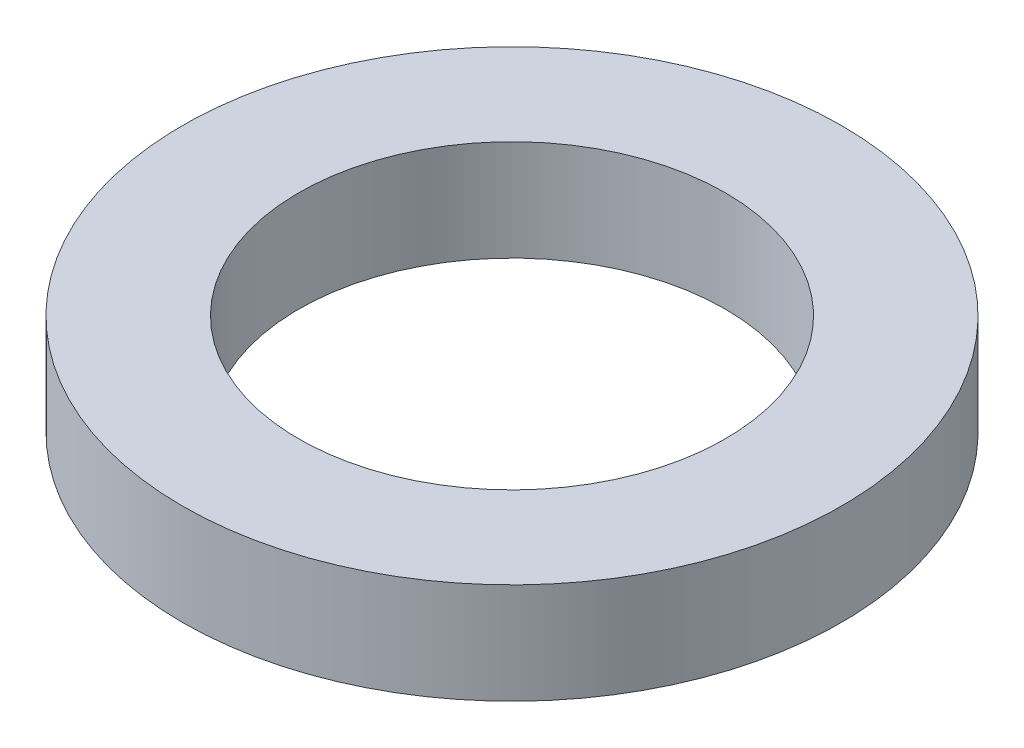
ISO-10303-21;
HEADER;
FILE_DESCRIPTION(('STEP AP214'),'2;1');
FILE_NAME('part.step','',(''),(''),'','','');
FILE_SCHEMA(('AUTOMOTIVE_DESIGN { 1 0 10303 214 1 1 1 1 }'));
ENDSEC;
DATA;
#1=APPLICATION_CONTEXT('core data for automotive mechanical design processes');
#2=APPLICATION_PROTOCOL_DEFINITION('international standard','automotive_design',2000,#1);
#3=PRODUCT_CONTEXT('',#1,'mechanical');
#4=PRODUCT('Part','Part','',(#3));
#5=PRODUCT_RELATED_PRODUCT_CATEGORY('part','',(#4));
#6=PRODUCT_DEFINITION_FORMATION('','',#4);
#7=PRODUCT_DEFINITION_CONTEXT('part definition',#1,'design');
#8=PRODUCT_DEFINITION('design','',#6,#7);
#9=PRODUCT_DEFINITION_SHAPE('','',#8);
#10=(LENGTH_UNIT() NAMED_UNIT(*) SI_UNIT(.MILLI.,.METRE.));
#11=(NAMED_UNIT(*) PLANE_ANGLE_UNIT() SI_UNIT($,.RADIAN.));
#12=(NAMED_UNIT(*) SI_UNIT($,.STERADIAN.) SOLID_ANGLE_UNIT());
#13=UNCERTAINTY_MEASURE_WITH_UNIT(LENGTH_MEASURE(1.E-05),#10,'distance_accuracy_value','');
#14=(GEOMETRIC_REPRESENTATION_CONTEXT(3) GLOBAL_UNCERTAINTY_ASSIGNED_CONTEXT((#13)) GLOBAL_UNIT_ASSIGNED_CONTEXT((#10,
#11,#12)) REPRESENTATION_CONTEXT('',''));
#15=CARTESIAN_POINT('',(0.,0.,0.));
#16=DIRECTION('',(0.,0.,1.));
#17=DIRECTION('',(1.,0.,0.));
#18=AXIS2_PLACEMENT_3D('',#15,#16,#17);
#19=CARTESIAN_POINT('',(0.,13.,0.));
#20=DIRECTION('',(0.,-1.,0.));
#21=DIRECTION('',(0.,0.,-1.));
#22=AXIS2_PLACEMENT_3D('',#19,#20,#21);
#23=CYLINDRICAL_SURFACE('',#22,42.5);
#24=CARTESIAN_POINT('',(0.,13.,0.));
#25=DIRECTION('',(0.,1.,0.));
#26=DIRECTION('',(0.,0.,1.));
#27=AXIS2_PLACEMENT_3D('',#24,#25,#26);
#28=CIRCLE('',#27,42.5);
#29=CARTESIAN_POINT('',(0.,13.,-42.5));
#30=VERTEX_POINT('',#29);
#31=EDGE_CURVE('E10',#30,#30,#28,.T.);
#32=CARTESIAN_POINT('',(0.,0.,0.));
#33=DIRECTION('',(0.,1.,0.));
#34=DIRECTION('',(0.,0.,1.));
#35=AXIS2_PLACEMENT_3D('',#32,#33,#34);
#36=CIRCLE('',#35,42.5);
#37=CARTESIAN_POINT('',(0.,0.,-42.5));
#38=VERTEX_POINT('',#37);
#39=EDGE_CURVE('E37',#38,#38,#36,.T.);
#40=CARTESIAN_POINT('',(0.,13.,-42.5));
#41=CARTESIAN_POINT('',(0.,12.8645833333333,-42.5));
#42=CARTESIAN_POINT('',(0.,12.7291666666667,-42.5));
#43=CARTESIAN_POINT('',(0.,12.4583333333333,-42.5));
#44=CARTESIAN_POINT('',(0.,12.3229166666667,-42.5));
#45=CARTESIAN_POINT('',(0.,12.0520833333333,-42.5));
#46=CARTESIAN_POINT('',(0.,11.9166666666667,-42.5));
#47=CARTESIAN_POINT('',(0.,11.6458333333333,-42.5));
#48=CARTESIAN_POINT('',(0.,11.5104166666667,-42.5));
#49=CARTESIAN_POINT('',(0.,11.2395833333333,-42.5));
#50=CARTESIAN_POINT('',(0.,11.1041666666667,-42.5));
#51=CARTESIAN_POINT('',(0.,10.8333333333333,-42.5));
#52=CARTESIAN_POINT('',(0.,10.6979166666667,-42.5));
#53=CARTESIAN_POINT('',(0.,10.4270833333333,-42.5));
#54=CARTESIAN_POINT('',(0.,10.2916666666667,-42.5));
#55=CARTESIAN_POINT('',(0.,10.0208333333333,-42.5));
#56=CARTESIAN_POINT('',(0.,9.88541666666667,-42.5));
#57=CARTESIAN_POINT('',(0.,9.61458333333333,-42.5));
#58=CARTESIAN_POINT('',(0.,9.47916666666667,-42.5));
#59=CARTESIAN_POINT('',(0.,9.20833333333333,-42.5));
#60=CARTESIAN_POINT('',(0.,9.07291666666666,-42.5));
#61=CARTESIAN_POINT('',(0.,8.80208333333333,-42.5));
#62=CARTESIAN_POINT('',(0.,8.66666666666667,-42.5));
#63=CARTESIAN_POINT('',(0.,8.39583333333333,-42.5));
#64=CARTESIAN_POINT('',(0.,8.26041666666667,-42.5));
#65=CARTESIAN_POINT('',(0.,7.98958333333333,-42.5));
#66=CARTESIAN_POINT('',(0.,7.85416666666667,-42.5));
#67=CARTESIAN_POINT('',(0.,7.58333333333333,-42.5));
#68=CARTESIAN_POINT('',(0.,7.44791666666667,-42.5));
#69=CARTESIAN_POINT('',(0.,7.17708333333333,-42.5));
#70=CARTESIAN_POINT('',(0.,7.04166666666667,-42.5));
#71=CARTESIAN_POINT('',(0.,6.77083333333333,-42.5));
#72=CARTESIAN_POINT('',(0.,6.63541666666667,-42.5));
#73=CARTESIAN_POINT('',(0.,6.36458333333333,-42.5));
#74=CARTESIAN_POINT('',(0.,6.22916666666667,-42.5));
#75=CARTESIAN_POINT('',(0.,5.95833333333333,-42.5));
#76=CARTESIAN_POINT('',(0.,5.82291666666667,-42.5));
#77=CARTESIAN_POINT('',(0.,5.55208333333333,-42.5));
#78=CARTESIAN_POINT('',(0.,5.41666666666667,-42.5));
#79=CARTESIAN_POINT('',(0.,5.14583333333333,-42.5));
#80=CARTESIAN_POINT('',(0.,5.01041666666667,-42.5));
#81=CARTESIAN_POINT('',(0.,4.73958333333333,-42.5));
#82=CARTESIAN_POINT('',(0.,4.60416666666667,-42.5));
#83=CARTESIAN_POINT('',(0.,4.33333333333333,-42.5));
#84=CARTESIAN_POINT('',(0.,4.19791666666667,-42.5));
#85=CARTESIAN_POINT('',(0.,3.92708333333333,-42.5));
#86=CARTESIAN_POINT('',(0.,3.79166666666667,-42.5));
#87=CARTESIAN_POINT('',(0.,3.52083333333333,-42.5));
#88=CARTESIAN_POINT('',(0.,3.38541666666667,-42.5));
#89=CARTESIAN_POINT('',(0.,3.11458333333333,-42.5));
#90=CARTESIAN_POINT('',(0.,2.97916666666667,-42.5));
#91=CARTESIAN_POINT('',(0.,2.70833333333333,-42.5));
#92=CARTESIAN_POINT('',(0.,2.57291666666667,-42.5));
#93=CARTESIAN_POINT('',(0.,2.30208333333333,-42.5));
#94=CARTESIAN_POINT('',(0.,2.16666666666667,-42.5));
#95=CARTESIAN_POINT('',(0.,1.89583333333333,-42.5));
#96=CARTESIAN_POINT('',(0.,1.76041666666667,-42.5));
#97=CARTESIAN_POINT('',(0.,1.48958333333333,-42.5));
#98=CARTESIAN_POINT('',(0.,1.35416666666667,-42.5));
#99=CARTESIAN_POINT('',(0.,1.08333333333333,-42.5));
#100=CARTESIAN_POINT('',(0.,0.947916666666667,-42.5));
#101=CARTESIAN_POINT('',(0.,0.677083333333334,-42.5));
#102=CARTESIAN_POINT('',(0.,0.541666666666667,-42.5));
#103=CARTESIAN_POINT('',(0.,0.270833333333334,-42.5));
#104=CARTESIAN_POINT('',(0.,0.135416666666667,-42.5));
#105=CARTESIAN_POINT('',(0.,0.,-42.5));
#106=B_SPLINE_CURVE_WITH_KNOTS('',3,(#40,#41,#42,#43,#44,#45,#46,#47,#48,#49,#50,#51,#52,#53,
#54,#55,#56,#57,#58,#59,#60,#61,#62,#63,#64,#65,#66,#67,#68,#69,#70,#71,#72,#73,#74,#75,#76,#77,
#78,#79,#80,#81,#82,#83,#84,#85,#86,#87,#88,#89,#90,#91,#92,#93,#94,#95,#96,#97,#98,#99,#100,
#101,#102,#103,#104,#105),.UNSPECIFIED.,.F.,.F.,(4,2,2,2,2,2,2,2,2,2,2,2,2,2,2,2,2,2,2,2,2,2,2,
2,2,2,2,2,2,2,2,2,4),(0.,0.40625,0.812500000000001,1.21875,1.625,2.03125,2.4375,2.84375,3.25,
3.65625,4.0625,4.46875,4.875,5.28125,5.6875,6.09375,6.5,6.90625,7.3125,7.71875,8.125,8.53125,
8.9375,9.34375,9.75,10.15625,10.5625,10.96875,11.375,11.78125,12.1875,12.59375,13.),.UNSPECIFIED.);
#107=EDGE_CURVE('BSEAM40',#30,#38,#106,.T.);
#108=ORIENTED_EDGE('',*,*,#31,.F.);
#109=ORIENTED_EDGE('',*,*,#39,.T.);
#110=ORIENTED_EDGE('',*,*,#107,.T.);
#111=ORIENTED_EDGE('',*,*,#107,.F.);
#112=EDGE_LOOP('',(#108,#110,#109,#111));
#113=FACE_BOUND('',#112,.T.);
#114=ADVANCED_FACE('F40',(#113),#23,.T.);
#115=CARTESIAN_POINT('',(0.,13.,0.));
#116=DIRECTION('',(0.,1.,0.));
#117=DIRECTION('',(0.,0.,1.));
#118=AXIS2_PLACEMENT_3D('',#115,#116,#117);
#119=PLANE('',#118);
#120=CARTESIAN_POINT('',(0.,13.,0.));
#121=DIRECTION('',(0.,1.,0.));
#122=DIRECTION('',(0.,0.,1.));
#123=AXIS2_PLACEMENT_3D('',#120,#121,#122);
#124=CIRCLE('',#123,27.5);
#125=CARTESIAN_POINT('',(0.,13.,-27.5));
#126=VERTEX_POINT('',#125);
#127=EDGE_CURVE('E50',#126,#126,#124,.T.);
#128=ORIENTED_EDGE('',*,*,#127,.F.);
#129=EDGE_LOOP('',(#128));
#130=FACE_BOUND('',#129,.T.);
#131=ORIENTED_EDGE('',*,*,#31,.T.);
#132=EDGE_LOOP('',(#131));
#133=FACE_BOUND('',#132,.T.);
#134=ADVANCED_FACE('F59',(#130,#133),#119,.T.);
#135=CARTESIAN_POINT('',(0.,0.,0.));
#136=DIRECTION('',(0.,1.,0.));
#137=DIRECTION('',(0.,0.,1.));
#138=AXIS2_PLACEMENT_3D('',#135,#136,#137);
#139=PLANE('',#138);
#140=CARTESIAN_POINT('',(0.,0.,0.));
#141=DIRECTION('',(0.,1.,0.));
#142=DIRECTION('',(0.,0.,1.));
#143=AXIS2_PLACEMENT_3D('',#140,#141,#142);
#144=CIRCLE('',#143,27.5);
#145=CARTESIAN_POINT('',(0.,0.,-27.5));
#146=VERTEX_POINT('',#145);
#147=EDGE_CURVE('E47',#146,#146,#144,.T.);
#148=ORIENTED_EDGE('',*,*,#147,.T.);
#149=EDGE_LOOP('',(#148));
#150=FACE_BOUND('',#149,.T.);
#151=ORIENTED_EDGE('',*,*,#39,.F.);
#152=EDGE_LOOP('',(#151));
#153=FACE_BOUND('',#152,.T.);
#154=ADVANCED_FACE('F58',(#150,#153),#139,.F.);
#155=CARTESIAN_POINT('',(0.,13.,0.));
#156=DIRECTION('',(0.,-1.,0.));
#157=DIRECTION('',(0.,0.,-1.));
#158=AXIS2_PLACEMENT_3D('',#155,#156,#157);
#159=CYLINDRICAL_SURFACE('',#158,27.5);
#160=CARTESIAN_POINT('',(0.,13.,-27.5));
#161=CARTESIAN_POINT('',(0.,12.8645833333333,-27.5));
#162=CARTESIAN_POINT('',(0.,12.7291666666667,-27.5));
#163=CARTESIAN_POINT('',(0.,12.4583333333333,-27.5));
#164=CARTESIAN_POINT('',(0.,12.3229166666667,-27.5));
#165=CARTESIAN_POINT('',(0.,12.0520833333333,-27.5));
#166=CARTESIAN_POINT('',(0.,11.9166666666667,-27.5));
#167=CARTESIAN_POINT('',(0.,11.6458333333333,-27.5));
#168=CARTESIAN_POINT('',(0.,11.5104166666667,-27.5));
#169=CARTESIAN_POINT('',(0.,11.2395833333333,-27.5));
#170=CARTESIAN_POINT('',(0.,11.1041666666667,-27.5));
#171=CARTESIAN_POINT('',(0.,10.8333333333333,-27.5));
#172=CARTESIAN_POINT('',(0.,10.6979166666667,-27.5));
#173=CARTESIAN_POINT('',(0.,10.4270833333333,-27.5));
#174=CARTESIAN_POINT('',(0.,10.2916666666667,-27.5));
#175=CARTESIAN_POINT('',(0.,10.0208333333333,-27.5));
#176=CARTESIAN_POINT('',(0.,9.88541666666667,-27.5));
#177=CARTESIAN_POINT('',(0.,9.61458333333333,-27.5));
#178=CARTESIAN_POINT('',(0.,9.47916666666667,-27.5));
#179=CARTESIAN_POINT('',(0.,9.20833333333333,-27.5));
#180=CARTESIAN_POINT('',(0.,9.07291666666666,-27.5));
#181=CARTESIAN_POINT('',(0.,8.80208333333333,-27.5));
#182=CARTESIAN_POINT('',(0.,8.66666666666667,-27.5));
#183=CARTESIAN_POINT('',(0.,8.39583333333333,-27.5));
#184=CARTESIAN_POINT('',(0.,8.26041666666667,-27.5));
#185=CARTESIAN_POINT('',(0.,7.98958333333333,-27.5));
#186=CARTESIAN_POINT('',(0.,7.85416666666667,-27.5));
#187=CARTESIAN_POINT('',(0.,7.58333333333333,-27.5));
#188=CARTESIAN_POINT('',(0.,7.44791666666667,-27.5));
#189=CARTESIAN_POINT('',(0.,7.17708333333333,-27.5));
#190=CARTESIAN_POINT('',(0.,7.04166666666667,-27.5));
#191=CARTESIAN_POINT('',(0.,6.77083333333333,-27.5));
#192=CARTESIAN_POINT('',(0.,6.63541666666667,-27.5));
#193=CARTESIAN_POINT('',(0.,6.36458333333333,-27.5));
#194=CARTESIAN_POINT('',(0.,6.22916666666667,-27.5));
#195=CARTESIAN_POINT('',(0.,5.95833333333333,-27.5));
#196=CARTESIAN_POINT('',(0.,5.82291666666667,-27.5));
#197=CARTESIAN_POINT('',(0.,5.55208333333333,-27.5));
#198=CARTESIAN_POINT('',(0.,5.41666666666667,-27.5));
#199=CARTESIAN_POINT('',(0.,5.14583333333333,-27.5));
#200=CARTESIAN_POINT('',(0.,5.01041666666667,-27.5));
#201=CARTESIAN_POINT('',(0.,4.73958333333333,-27.5));
#202=CARTESIAN_POINT('',(0.,4.60416666666667,-27.5));
#203=CARTESIAN_POINT('',(0.,4.33333333333333,-27.5));
#204=CARTESIAN_POINT('',(0.,4.19791666666667,-27.5));
#205=CARTESIAN_POINT('',(0.,3.92708333333333,-27.5));
#206=CARTESIAN_POINT('',(0.,3.79166666666667,-27.5));
#207=CARTESIAN_POINT('',(0.,3.52083333333333,-27.5));
#208=CARTESIAN_POINT('',(0.,3.38541666666667,-27.5));
#209=CARTESIAN_POINT('',(0.,3.11458333333333,-27.5));
#210=CARTESIAN_POINT('',(0.,2.97916666666667,-27.5));
#211=CARTESIAN_POINT('',(0.,2.70833333333333,-27.5));
#212=CARTESIAN_POINT('',(0.,2.57291666666667,-27.5));
#213=CARTESIAN_POINT('',(0.,2.30208333333333,-27.5));
#214=CARTESIAN_POINT('',(0.,2.16666666666667,-27.5));
#215=CARTESIAN_POINT('',(0.,1.89583333333333,-27.5));
#216=CARTESIAN_POINT('',(0.,1.76041666666667,-27.5));
#217=CARTESIAN_POINT('',(0.,1.48958333333333,-27.5));
#218=CARTESIAN_POINT('',(0.,1.35416666666667,-27.5));
#219=CARTESIAN_POINT('',(0.,1.08333333333333,-27.5));
#220=CARTESIAN_POINT('',(0.,0.947916666666667,-27.5));
#221=CARTESIAN_POINT('',(0.,0.677083333333334,-27.5));
#222=CARTESIAN_POINT('',(0.,0.541666666666667,-27.5));
#223=CARTESIAN_POINT('',(0.,0.270833333333334,-27.5));
#224=CARTESIAN_POINT('',(0.,0.135416666666667,-27.5));
#225=CARTESIAN_POINT('',(0.,0.,-27.5));
#226=B_SPLINE_CURVE_WITH_KNOTS('',3,(#160,#161,#162,#163,#164,#165,#166,#167,#168,#169,#170,
#171,#172,#173,#174,#175,#176,#177,#178,#179,#180,#181,#182,#183,#184,#185,#186,#187,#188,#189,
#190,#191,#192,#193,#194,#195,#196,#197,#198,#199,#200,#201,#202,#203,#204,#205,#206,#207,#208,
#209,#210,#211,#212,#213,#214,#215,#216,#217,#218,#219,#220,#221,#222,#223,#224,#225),
.UNSPECIFIED.,.F.,.F.,(4,2,2,2,2,2,2,2,2,2,2,2,2,2,2,2,2,2,2,2,2,2,2,2,2,2,2,2,2,2,2,2,4),(0.,
0.40625,0.812500000000001,1.21875,1.625,2.03125,2.4375,2.84375,3.25,3.65625,4.0625,4.46875,
4.875,5.28125,5.6875,6.09375,6.5,6.90625,7.3125,7.71875,8.125,8.53125,8.9375,9.34375,9.75,
10.15625,10.5625,10.96875,11.375,11.78125,12.1875,12.59375,13.),.UNSPECIFIED.);
#227=EDGE_CURVE('BSEAM54',#126,#146,#226,.T.);
#228=ORIENTED_EDGE('',*,*,#127,.T.);
#229=ORIENTED_EDGE('',*,*,#147,.F.);
#230=ORIENTED_EDGE('',*,*,#227,.T.);
#231=ORIENTED_EDGE('',*,*,#227,.F.);
#232=EDGE_LOOP('',(#228,#230,#229,#231));
#233=FACE_BOUND('',#232,.T.);
#234=ADVANCED_FACE('F54',(#233),#159,.F.);
#235=CLOSED_SHELL('',(#114,#134,#154,#234));
#236=MANIFOLD_SOLID_BREP('B2',#235);
#237=ADVANCED_BREP_SHAPE_REPRESENTATION('',(#18,#236),#14);
#238=SHAPE_DEFINITION_REPRESENTATION(#9,#237);
ENDSEC;
END-ISO-10303-21;
